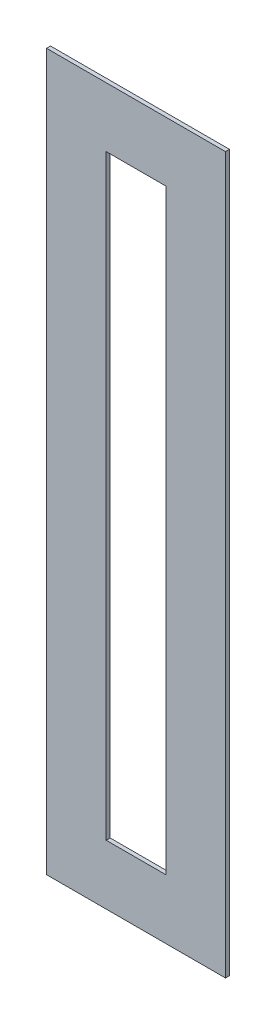
ISO-10303-21;
HEADER;
FILE_DESCRIPTION(('STEP AP214'),'2;1');
FILE_NAME('part.step','',(''),(''),'','','');
FILE_SCHEMA(('AUTOMOTIVE_DESIGN { 1 0 10303 214 1 1 1 1 }'));
ENDSEC;
DATA;
#1=APPLICATION_CONTEXT('core data for automotive mechanical design processes');
#2=APPLICATION_PROTOCOL_DEFINITION('international standard','automotive_design',2000,#1);
#3=PRODUCT_CONTEXT('',#1,'mechanical');
#4=PRODUCT('Part','Part','',(#3));
#5=PRODUCT_RELATED_PRODUCT_CATEGORY('part','',(#4));
#6=PRODUCT_DEFINITION_FORMATION('','',#4);
#7=PRODUCT_DEFINITION_CONTEXT('part definition',#1,'design');
#8=PRODUCT_DEFINITION('design','',#6,#7);
#9=PRODUCT_DEFINITION_SHAPE('','',#8);
#10=(LENGTH_UNIT() NAMED_UNIT(*) SI_UNIT(.MILLI.,.METRE.));
#11=(NAMED_UNIT(*) PLANE_ANGLE_UNIT() SI_UNIT($,.RADIAN.));
#12=(NAMED_UNIT(*) SI_UNIT($,.STERADIAN.) SOLID_ANGLE_UNIT());
#13=UNCERTAINTY_MEASURE_WITH_UNIT(LENGTH_MEASURE(1.E-05),#10,'distance_accuracy_value','');
#14=(GEOMETRIC_REPRESENTATION_CONTEXT(3) GLOBAL_UNCERTAINTY_ASSIGNED_CONTEXT((#13)) GLOBAL_UNIT_ASSIGNED_CONTEXT((#10,
#11,#12)) REPRESENTATION_CONTEXT('',''));
#15=CARTESIAN_POINT('',(0.,0.,0.));
#16=DIRECTION('',(0.,0.,1.));
#17=DIRECTION('',(1.,0.,0.));
#18=AXIS2_PLACEMENT_3D('',#15,#16,#17);
#19=CARTESIAN_POINT('',(0.,0.,0.2));
#20=DIRECTION('',(0.,0.,-1.));
#21=DIRECTION('',(-1.,0.,0.));
#22=AXIS2_PLACEMENT_3D('',#19,#20,#21);
#23=PLANE('',#22);
#24=DIRECTION('',(0.,1.,0.));
#25=VECTOR('',#24,1.);
#26=CARTESIAN_POINT('',(4.5,18.,0.2));
#27=LINE('',#26,#25);
#28=CARTESIAN_POINT('',(4.5,-18.,0.2));
#29=VERTEX_POINT('',#28);
#30=CARTESIAN_POINT('',(4.5,18.,0.2));
#31=VERTEX_POINT('',#30);
#32=EDGE_CURVE('E133',#29,#31,#27,.T.);
#33=ORIENTED_EDGE('',*,*,#32,.T.);
#34=DIRECTION('',(-1.,0.,0.));
#35=VECTOR('',#34,1.);
#36=CARTESIAN_POINT('',(4.5,18.,0.2));
#37=LINE('',#36,#35);
#38=CARTESIAN_POINT('',(-4.5,18.,0.2));
#39=VERTEX_POINT('',#38);
#40=EDGE_CURVE('E136',#31,#39,#37,.T.);
#41=ORIENTED_EDGE('',*,*,#40,.T.);
#42=DIRECTION('',(0.,-1.,0.));
#43=VECTOR('',#42,1.);
#44=CARTESIAN_POINT('',(-4.5,18.,0.2));
#45=LINE('',#44,#43);
#46=CARTESIAN_POINT('',(-4.5,-18.,0.2));
#47=VERTEX_POINT('',#46);
#48=EDGE_CURVE('E139',#39,#47,#45,.T.);
#49=ORIENTED_EDGE('',*,*,#48,.T.);
#50=DIRECTION('',(1.,0.,0.));
#51=VECTOR('',#50,1.);
#52=CARTESIAN_POINT('',(4.5,-18.,0.2));
#53=LINE('',#52,#51);
#54=EDGE_CURVE('E141',#47,#29,#53,.T.);
#55=ORIENTED_EDGE('',*,*,#54,.T.);
#56=EDGE_LOOP('',(#33,#41,#49,#55));
#57=FACE_BOUND('',#56,.T.);
#58=DIRECTION('',(0.,-1.,0.));
#59=VECTOR('',#58,1.);
#60=CARTESIAN_POINT('',(-1.5,15.,0.2));
#61=LINE('',#60,#59);
#62=CARTESIAN_POINT('',(-1.5,15.,0.2));
#63=VERTEX_POINT('',#62);
#64=CARTESIAN_POINT('',(-1.5,-15.,0.2));
#65=VERTEX_POINT('',#64);
#66=EDGE_CURVE('E97',#63,#65,#61,.T.);
#67=ORIENTED_EDGE('',*,*,#66,.F.);
#68=DIRECTION('',(-1.,0.,0.));
#69=VECTOR('',#68,1.);
#70=CARTESIAN_POINT('',(1.5,15.,0.2));
#71=LINE('',#70,#69);
#72=CARTESIAN_POINT('',(1.5,15.,0.2));
#73=VERTEX_POINT('',#72);
#74=EDGE_CURVE('E119',#73,#63,#71,.T.);
#75=ORIENTED_EDGE('',*,*,#74,.F.);
#76=DIRECTION('',(0.,1.,0.));
#77=VECTOR('',#76,1.);
#78=CARTESIAN_POINT('',(1.5,15.,0.2));
#79=LINE('',#78,#77);
#80=CARTESIAN_POINT('',(1.5,-15.,0.2));
#81=VERTEX_POINT('',#80);
#82=EDGE_CURVE('E117',#81,#73,#79,.T.);
#83=ORIENTED_EDGE('',*,*,#82,.F.);
#84=DIRECTION('',(1.,0.,0.));
#85=VECTOR('',#84,1.);
#86=CARTESIAN_POINT('',(1.5,-15.,0.2));
#87=LINE('',#86,#85);
#88=EDGE_CURVE('E105',#65,#81,#87,.T.);
#89=ORIENTED_EDGE('',*,*,#88,.F.);
#90=EDGE_LOOP('',(#67,#75,#83,#89));
#91=FACE_BOUND('',#90,.T.);
#92=ADVANCED_FACE('F32',(#57,#91),#23,.F.);
#93=CARTESIAN_POINT('',(0.,0.,0.));
#94=DIRECTION('',(0.,0.,-1.));
#95=DIRECTION('',(-1.,0.,0.));
#96=AXIS2_PLACEMENT_3D('',#93,#94,#95);
#97=PLANE('',#96);
#98=DIRECTION('',(0.,1.,0.));
#99=VECTOR('',#98,1.);
#100=CARTESIAN_POINT('',(4.5,18.,0.));
#101=LINE('',#100,#99);
#102=CARTESIAN_POINT('',(4.5,-18.,0.));
#103=VERTEX_POINT('',#102);
#104=CARTESIAN_POINT('',(4.5,18.,0.));
#105=VERTEX_POINT('',#104);
#106=EDGE_CURVE('E113',#103,#105,#101,.T.);
#107=ORIENTED_EDGE('',*,*,#106,.F.);
#108=DIRECTION('',(1.,0.,0.));
#109=VECTOR('',#108,1.);
#110=CARTESIAN_POINT('',(4.5,-18.,0.));
#111=LINE('',#110,#109);
#112=CARTESIAN_POINT('',(-4.5,-18.,0.));
#113=VERTEX_POINT('',#112);
#114=EDGE_CURVE('E137',#113,#103,#111,.T.);
#115=ORIENTED_EDGE('',*,*,#114,.F.);
#116=DIRECTION('',(0.,-1.,0.));
#117=VECTOR('',#116,1.);
#118=CARTESIAN_POINT('',(-4.5,18.,0.));
#119=LINE('',#118,#117);
#120=CARTESIAN_POINT('',(-4.5,18.,0.));
#121=VERTEX_POINT('',#120);
#122=EDGE_CURVE('E148',#121,#113,#119,.T.);
#123=ORIENTED_EDGE('',*,*,#122,.F.);
#124=DIRECTION('',(-1.,0.,0.));
#125=VECTOR('',#124,1.);
#126=CARTESIAN_POINT('',(4.5,18.,0.));
#127=LINE('',#126,#125);
#128=EDGE_CURVE('E146',#105,#121,#127,.T.);
#129=ORIENTED_EDGE('',*,*,#128,.F.);
#130=EDGE_LOOP('',(#107,#115,#123,#129));
#131=FACE_BOUND('',#130,.T.);
#132=DIRECTION('',(-1.,0.,0.));
#133=VECTOR('',#132,1.);
#134=CARTESIAN_POINT('',(1.5,15.,0.));
#135=LINE('',#134,#133);
#136=CARTESIAN_POINT('',(1.5,15.,0.));
#137=VERTEX_POINT('',#136);
#138=CARTESIAN_POINT('',(-1.5,15.,0.));
#139=VERTEX_POINT('',#138);
#140=EDGE_CURVE('E106',#137,#139,#135,.T.);
#141=ORIENTED_EDGE('',*,*,#140,.T.);
#142=DIRECTION('',(0.,-1.,0.));
#143=VECTOR('',#142,1.);
#144=CARTESIAN_POINT('',(-1.5,15.,0.));
#145=LINE('',#144,#143);
#146=CARTESIAN_POINT('',(-1.5,-15.,0.));
#147=VERTEX_POINT('',#146);
#148=EDGE_CURVE('E55',#139,#147,#145,.T.);
#149=ORIENTED_EDGE('',*,*,#148,.T.);
#150=DIRECTION('',(1.,0.,0.));
#151=VECTOR('',#150,1.);
#152=CARTESIAN_POINT('',(1.5,-15.,0.));
#153=LINE('',#152,#151);
#154=CARTESIAN_POINT('',(1.5,-15.,0.));
#155=VERTEX_POINT('',#154);
#156=EDGE_CURVE('E112',#147,#155,#153,.T.);
#157=ORIENTED_EDGE('',*,*,#156,.T.);
#158=DIRECTION('',(0.,1.,0.));
#159=VECTOR('',#158,1.);
#160=CARTESIAN_POINT('',(1.5,15.,0.));
#161=LINE('',#160,#159);
#162=EDGE_CURVE('E125',#155,#137,#161,.T.);
#163=ORIENTED_EDGE('',*,*,#162,.T.);
#164=EDGE_LOOP('',(#141,#149,#157,#163));
#165=FACE_BOUND('',#164,.T.);
#166=ADVANCED_FACE('F166',(#131,#165),#97,.T.);
#167=CARTESIAN_POINT('',(4.5,18.,0.2));
#168=DIRECTION('',(-1.,0.,0.));
#169=DIRECTION('',(0.,-1.,0.));
#170=AXIS2_PLACEMENT_3D('',#167,#168,#169);
#171=PLANE('',#170);
#172=ORIENTED_EDGE('',*,*,#106,.T.);
#173=DIRECTION('',(0.,0.,-1.));
#174=VECTOR('',#173,1.);
#175=CARTESIAN_POINT('',(4.5,18.,0.2));
#176=LINE('',#175,#174);
#177=EDGE_CURVE('E11',#31,#105,#176,.T.);
#178=ORIENTED_EDGE('',*,*,#177,.F.);
#179=ORIENTED_EDGE('',*,*,#32,.F.);
#180=DIRECTION('',(0.,0.,-1.));
#181=VECTOR('',#180,1.);
#182=CARTESIAN_POINT('',(4.5,-18.,0.2));
#183=LINE('',#182,#181);
#184=EDGE_CURVE('E143',#29,#103,#183,.T.);
#185=ORIENTED_EDGE('',*,*,#184,.T.);
#186=EDGE_LOOP('',(#172,#178,#179,#185));
#187=FACE_BOUND('',#186,.T.);
#188=ADVANCED_FACE('F34',(#187),#171,.F.);
#189=CARTESIAN_POINT('',(4.5,18.,0.2));
#190=DIRECTION('',(0.,-1.,0.));
#191=DIRECTION('',(1.,0.,0.));
#192=AXIS2_PLACEMENT_3D('',#189,#190,#191);
#193=PLANE('',#192);
#194=ORIENTED_EDGE('',*,*,#128,.T.);
#195=DIRECTION('',(0.,0.,-1.));
#196=VECTOR('',#195,1.);
#197=CARTESIAN_POINT('',(-4.5,18.,0.2));
#198=LINE('',#197,#196);
#199=EDGE_CURVE('E40',#39,#121,#198,.T.);
#200=ORIENTED_EDGE('',*,*,#199,.F.);
#201=ORIENTED_EDGE('',*,*,#40,.F.);
#202=ORIENTED_EDGE('',*,*,#177,.T.);
#203=EDGE_LOOP('',(#194,#200,#201,#202));
#204=FACE_BOUND('',#203,.T.);
#205=ADVANCED_FACE('F176',(#204),#193,.F.);
#206=CARTESIAN_POINT('',(-4.5,18.,0.2));
#207=DIRECTION('',(1.,0.,0.));
#208=DIRECTION('',(0.,1.,0.));
#209=AXIS2_PLACEMENT_3D('',#206,#207,#208);
#210=PLANE('',#209);
#211=ORIENTED_EDGE('',*,*,#122,.T.);
#212=DIRECTION('',(0.,0.,-1.));
#213=VECTOR('',#212,1.);
#214=CARTESIAN_POINT('',(-4.5,-18.,0.2));
#215=LINE('',#214,#213);
#216=EDGE_CURVE('E153',#47,#113,#215,.T.);
#217=ORIENTED_EDGE('',*,*,#216,.F.);
#218=ORIENTED_EDGE('',*,*,#48,.F.);
#219=ORIENTED_EDGE('',*,*,#199,.T.);
#220=EDGE_LOOP('',(#211,#217,#218,#219));
#221=FACE_BOUND('',#220,.T.);
#222=ADVANCED_FACE('F160',(#221),#210,.F.);
#223=CARTESIAN_POINT('',(4.5,-18.,0.2));
#224=DIRECTION('',(0.,1.,0.));
#225=DIRECTION('',(-1.,0.,0.));
#226=AXIS2_PLACEMENT_3D('',#223,#224,#225);
#227=PLANE('',#226);
#228=ORIENTED_EDGE('',*,*,#114,.T.);
#229=ORIENTED_EDGE('',*,*,#184,.F.);
#230=ORIENTED_EDGE('',*,*,#54,.F.);
#231=ORIENTED_EDGE('',*,*,#216,.T.);
#232=EDGE_LOOP('',(#228,#229,#230,#231));
#233=FACE_BOUND('',#232,.T.);
#234=ADVANCED_FACE('F170',(#233),#227,.F.);
#235=CARTESIAN_POINT('',(-1.5,15.,0.2));
#236=DIRECTION('',(1.,0.,0.));
#237=DIRECTION('',(0.,1.,0.));
#238=AXIS2_PLACEMENT_3D('',#235,#236,#237);
#239=PLANE('',#238);
#240=ORIENTED_EDGE('',*,*,#148,.F.);
#241=DIRECTION('',(0.,0.,-1.));
#242=VECTOR('',#241,1.);
#243=CARTESIAN_POINT('',(-1.5,15.,0.2));
#244=LINE('',#243,#242);
#245=EDGE_CURVE('E101',#63,#139,#244,.T.);
#246=ORIENTED_EDGE('',*,*,#245,.F.);
#247=ORIENTED_EDGE('',*,*,#66,.T.);
#248=DIRECTION('',(0.,0.,-1.));
#249=VECTOR('',#248,1.);
#250=CARTESIAN_POINT('',(-1.5,-15.,0.2));
#251=LINE('',#250,#249);
#252=EDGE_CURVE('E100',#65,#147,#251,.T.);
#253=ORIENTED_EDGE('',*,*,#252,.T.);
#254=EDGE_LOOP('',(#240,#246,#247,#253));
#255=FACE_BOUND('',#254,.T.);
#256=ADVANCED_FACE('F99',(#255),#239,.T.);
#257=CARTESIAN_POINT('',(1.5,-15.,0.2));
#258=DIRECTION('',(0.,1.,0.));
#259=DIRECTION('',(-1.,0.,0.));
#260=AXIS2_PLACEMENT_3D('',#257,#258,#259);
#261=PLANE('',#260);
#262=ORIENTED_EDGE('',*,*,#156,.F.);
#263=ORIENTED_EDGE('',*,*,#252,.F.);
#264=ORIENTED_EDGE('',*,*,#88,.T.);
#265=DIRECTION('',(0.,0.,-1.));
#266=VECTOR('',#265,1.);
#267=CARTESIAN_POINT('',(1.5,-15.,0.2));
#268=LINE('',#267,#266);
#269=EDGE_CURVE('E114',#81,#155,#268,.T.);
#270=ORIENTED_EDGE('',*,*,#269,.T.);
#271=EDGE_LOOP('',(#262,#263,#264,#270));
#272=FACE_BOUND('',#271,.T.);
#273=ADVANCED_FACE('F109',(#272),#261,.T.);
#274=CARTESIAN_POINT('',(1.5,15.,0.2));
#275=DIRECTION('',(-1.,0.,0.));
#276=DIRECTION('',(0.,-1.,0.));
#277=AXIS2_PLACEMENT_3D('',#274,#275,#276);
#278=PLANE('',#277);
#279=ORIENTED_EDGE('',*,*,#162,.F.);
#280=ORIENTED_EDGE('',*,*,#269,.F.);
#281=ORIENTED_EDGE('',*,*,#82,.T.);
#282=DIRECTION('',(0.,0.,-1.));
#283=VECTOR('',#282,1.);
#284=CARTESIAN_POINT('',(1.5,15.,0.2));
#285=LINE('',#284,#283);
#286=EDGE_CURVE('E47',#73,#137,#285,.T.);
#287=ORIENTED_EDGE('',*,*,#286,.T.);
#288=EDGE_LOOP('',(#279,#280,#281,#287));
#289=FACE_BOUND('',#288,.T.);
#290=ADVANCED_FACE('F199',(#289),#278,.T.);
#291=CARTESIAN_POINT('',(1.5,15.,0.2));
#292=DIRECTION('',(0.,-1.,0.));
#293=DIRECTION('',(1.,0.,0.));
#294=AXIS2_PLACEMENT_3D('',#291,#292,#293);
#295=PLANE('',#294);
#296=ORIENTED_EDGE('',*,*,#140,.F.);
#297=ORIENTED_EDGE('',*,*,#286,.F.);
#298=ORIENTED_EDGE('',*,*,#74,.T.);
#299=ORIENTED_EDGE('',*,*,#245,.T.);
#300=EDGE_LOOP('',(#296,#297,#298,#299));
#301=FACE_BOUND('',#300,.T.);
#302=ADVANCED_FACE('F203',(#301),#295,.T.);
#303=CLOSED_SHELL('',(#92,#166,#188,#205,#222,#234,#256,#273,#290,#302));
#304=MANIFOLD_SOLID_BREP('B2',#303);
#305=ADVANCED_BREP_SHAPE_REPRESENTATION('',(#18,#304),#14);
#306=SHAPE_DEFINITION_REPRESENTATION(#9,#305);
ENDSEC;
END-ISO-10303-21;
